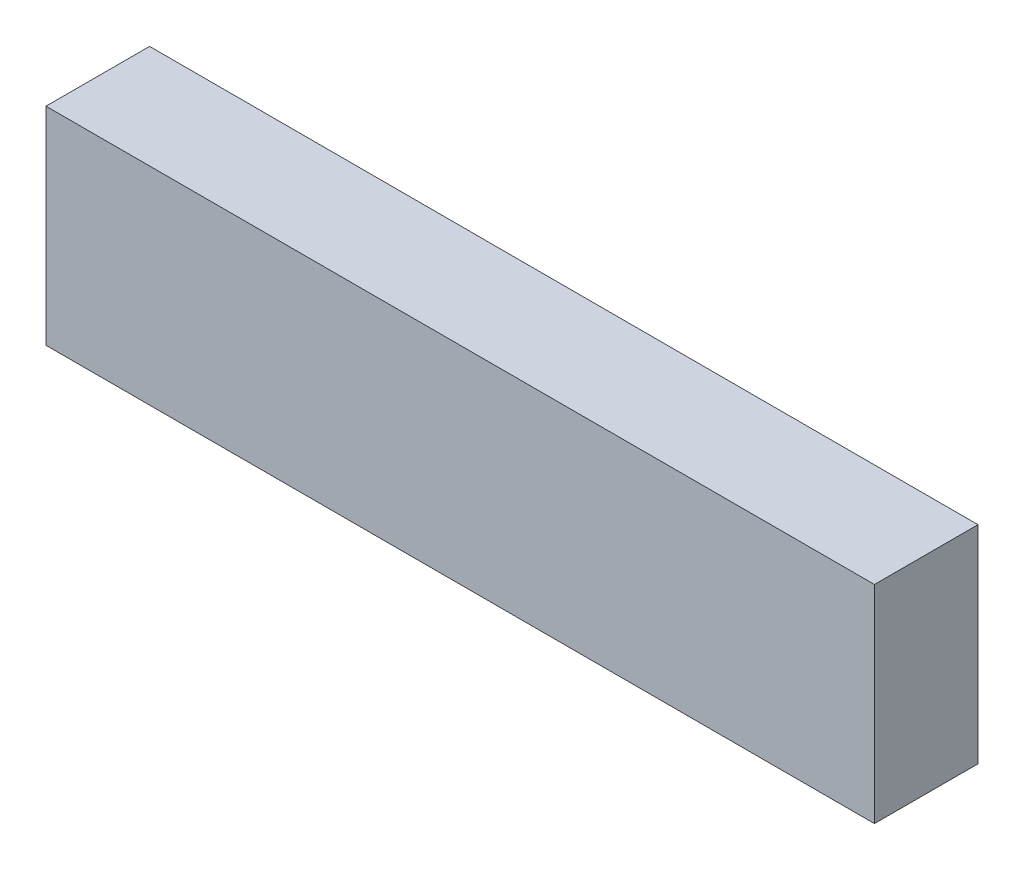
ISO-10303-21;
HEADER;
FILE_DESCRIPTION(('STEP AP214'),'2;1');
FILE_NAME('part.step','',(''),(''),'','','');
FILE_SCHEMA(('AUTOMOTIVE_DESIGN { 1 0 10303 214 1 1 1 1 }'));
ENDSEC;
DATA;
#1=APPLICATION_CONTEXT('core data for automotive mechanical design processes');
#2=APPLICATION_PROTOCOL_DEFINITION('international standard','automotive_design',2000,#1);
#3=PRODUCT_CONTEXT('',#1,'mechanical');
#4=PRODUCT('Part','Part','',(#3));
#5=PRODUCT_RELATED_PRODUCT_CATEGORY('part','',(#4));
#6=PRODUCT_DEFINITION_FORMATION('','',#4);
#7=PRODUCT_DEFINITION_CONTEXT('part definition',#1,'design');
#8=PRODUCT_DEFINITION('design','',#6,#7);
#9=PRODUCT_DEFINITION_SHAPE('','',#8);
#10=(LENGTH_UNIT() NAMED_UNIT(*) SI_UNIT(.MILLI.,.METRE.));
#11=(NAMED_UNIT(*) PLANE_ANGLE_UNIT() SI_UNIT($,.RADIAN.));
#12=(NAMED_UNIT(*) SI_UNIT($,.STERADIAN.) SOLID_ANGLE_UNIT());
#13=UNCERTAINTY_MEASURE_WITH_UNIT(LENGTH_MEASURE(1.E-05),#10,'distance_accuracy_value','');
#14=(GEOMETRIC_REPRESENTATION_CONTEXT(3) GLOBAL_UNCERTAINTY_ASSIGNED_CONTEXT((#13)) GLOBAL_UNIT_ASSIGNED_CONTEXT((#10,
#11,#12)) REPRESENTATION_CONTEXT('',''));
#15=CARTESIAN_POINT('',(0.,0.,0.));
#16=DIRECTION('',(0.,0.,1.));
#17=DIRECTION('',(1.,0.,0.));
#18=AXIS2_PLACEMENT_3D('',#15,#16,#17);
#19=CARTESIAN_POINT('',(0.,0.,63.5));
#20=DIRECTION('',(1.,0.,0.));
#21=DIRECTION('',(0.,0.,-1.));
#22=AXIS2_PLACEMENT_3D('',#19,#20,#21);
#23=PLANE('',#22);
#24=DIRECTION('',(0.,-1.,0.));
#25=VECTOR('',#24,1.);
#26=CARTESIAN_POINT('',(0.,0.,0.));
#27=LINE('',#26,#25);
#28=CARTESIAN_POINT('',(0.,127.,0.));
#29=VERTEX_POINT('',#28);
#30=CARTESIAN_POINT('',(0.,0.,0.));
#31=VERTEX_POINT('',#30);
#32=EDGE_CURVE('E96',#29,#31,#27,.T.);
#33=ORIENTED_EDGE('',*,*,#32,.T.);
#34=DIRECTION('',(0.,0.,-1.));
#35=VECTOR('',#34,1.);
#36=CARTESIAN_POINT('',(0.,0.,63.5));
#37=LINE('',#36,#35);
#38=CARTESIAN_POINT('',(0.,0.,63.5));
#39=VERTEX_POINT('',#38);
#40=EDGE_CURVE('E11',#39,#31,#37,.T.);
#41=ORIENTED_EDGE('',*,*,#40,.F.);
#42=DIRECTION('',(0.,-1.,0.));
#43=VECTOR('',#42,1.);
#44=CARTESIAN_POINT('',(0.,0.,63.5));
#45=LINE('',#44,#43);
#46=CARTESIAN_POINT('',(0.,127.,63.5));
#47=VERTEX_POINT('',#46);
#48=EDGE_CURVE('E84',#47,#39,#45,.T.);
#49=ORIENTED_EDGE('',*,*,#48,.F.);
#50=DIRECTION('',(0.,0.,-1.));
#51=VECTOR('',#50,1.);
#52=CARTESIAN_POINT('',(0.,127.,63.5));
#53=LINE('',#52,#51);
#54=EDGE_CURVE('E92',#47,#29,#53,.T.);
#55=ORIENTED_EDGE('',*,*,#54,.T.);
#56=EDGE_LOOP('',(#33,#41,#49,#55));
#57=FACE_BOUND('',#56,.T.);
#58=ADVANCED_FACE('F33',(#57),#23,.F.);
#59=CARTESIAN_POINT('',(0.,0.,63.5));
#60=DIRECTION('',(0.,1.,0.));
#61=DIRECTION('',(0.,0.,1.));
#62=AXIS2_PLACEMENT_3D('',#59,#60,#61);
#63=PLANE('',#62);
#64=DIRECTION('',(1.,0.,0.));
#65=VECTOR('',#64,1.);
#66=CARTESIAN_POINT('',(0.,0.,0.));
#67=LINE('',#66,#65);
#68=CARTESIAN_POINT('',(508.,0.,0.));
#69=VERTEX_POINT('',#68);
#70=EDGE_CURVE('E88',#31,#69,#67,.T.);
#71=ORIENTED_EDGE('',*,*,#70,.T.);
#72=DIRECTION('',(0.,0.,-1.));
#73=VECTOR('',#72,1.);
#74=CARTESIAN_POINT('',(508.,0.,63.5));
#75=LINE('',#74,#73);
#76=CARTESIAN_POINT('',(508.,0.,63.5));
#77=VERTEX_POINT('',#76);
#78=EDGE_CURVE('E41',#77,#69,#75,.T.);
#79=ORIENTED_EDGE('',*,*,#78,.F.);
#80=DIRECTION('',(1.,0.,0.));
#81=VECTOR('',#80,1.);
#82=CARTESIAN_POINT('',(0.,0.,63.5));
#83=LINE('',#82,#81);
#84=EDGE_CURVE('E79',#39,#77,#83,.T.);
#85=ORIENTED_EDGE('',*,*,#84,.F.);
#86=ORIENTED_EDGE('',*,*,#40,.T.);
#87=EDGE_LOOP('',(#71,#79,#85,#86));
#88=FACE_BOUND('',#87,.T.);
#89=ADVANCED_FACE('F87',(#88),#63,.F.);
#90=CARTESIAN_POINT('',(508.,0.,63.5));
#91=DIRECTION('',(-1.,0.,0.));
#92=DIRECTION('',(0.,0.,1.));
#93=AXIS2_PLACEMENT_3D('',#90,#91,#92);
#94=PLANE('',#93);
#95=DIRECTION('',(0.,1.,0.));
#96=VECTOR('',#95,1.);
#97=CARTESIAN_POINT('',(508.,0.,0.));
#98=LINE('',#97,#96);
#99=CARTESIAN_POINT('',(508.,127.,0.));
#100=VERTEX_POINT('',#99);
#101=EDGE_CURVE('E66',#69,#100,#98,.T.);
#102=ORIENTED_EDGE('',*,*,#101,.T.);
#103=DIRECTION('',(0.,0.,-1.));
#104=VECTOR('',#103,1.);
#105=CARTESIAN_POINT('',(508.,127.,63.5));
#106=LINE('',#105,#104);
#107=CARTESIAN_POINT('',(508.,127.,63.5));
#108=VERTEX_POINT('',#107);
#109=EDGE_CURVE('E89',#108,#100,#106,.T.);
#110=ORIENTED_EDGE('',*,*,#109,.F.);
#111=DIRECTION('',(0.,1.,0.));
#112=VECTOR('',#111,1.);
#113=CARTESIAN_POINT('',(508.,0.,63.5));
#114=LINE('',#113,#112);
#115=EDGE_CURVE('E82',#77,#108,#114,.T.);
#116=ORIENTED_EDGE('',*,*,#115,.F.);
#117=ORIENTED_EDGE('',*,*,#78,.T.);
#118=EDGE_LOOP('',(#102,#110,#116,#117));
#119=FACE_BOUND('',#118,.T.);
#120=ADVANCED_FACE('F90',(#119),#94,.F.);
#121=CARTESIAN_POINT('',(0.,127.,63.5));
#122=DIRECTION('',(0.,-1.,0.));
#123=DIRECTION('',(0.,0.,-1.));
#124=AXIS2_PLACEMENT_3D('',#121,#122,#123);
#125=PLANE('',#124);
#126=DIRECTION('',(-1.,0.,0.));
#127=VECTOR('',#126,1.);
#128=CARTESIAN_POINT('',(0.,127.,0.));
#129=LINE('',#128,#127);
#130=EDGE_CURVE('E72',#100,#29,#129,.T.);
#131=ORIENTED_EDGE('',*,*,#130,.T.);
#132=ORIENTED_EDGE('',*,*,#54,.F.);
#133=DIRECTION('',(-1.,0.,0.));
#134=VECTOR('',#133,1.);
#135=CARTESIAN_POINT('',(0.,127.,63.5));
#136=LINE('',#135,#134);
#137=EDGE_CURVE('E49',#108,#47,#136,.T.);
#138=ORIENTED_EDGE('',*,*,#137,.F.);
#139=ORIENTED_EDGE('',*,*,#109,.T.);
#140=EDGE_LOOP('',(#131,#132,#138,#139));
#141=FACE_BOUND('',#140,.T.);
#142=ADVANCED_FACE('F103',(#141),#125,.F.);
#143=CARTESIAN_POINT('',(0.,0.,63.5));
#144=DIRECTION('',(0.,0.,-1.));
#145=DIRECTION('',(-1.,0.,0.));
#146=AXIS2_PLACEMENT_3D('',#143,#144,#145);
#147=PLANE('',#146);
#148=ORIENTED_EDGE('',*,*,#48,.T.);
#149=ORIENTED_EDGE('',*,*,#84,.T.);
#150=ORIENTED_EDGE('',*,*,#115,.T.);
#151=ORIENTED_EDGE('',*,*,#137,.T.);
#152=EDGE_LOOP('',(#148,#149,#150,#151));
#153=FACE_BOUND('',#152,.T.);
#154=ADVANCED_FACE('F80',(#153),#147,.F.);
#155=CARTESIAN_POINT('',(0.,0.,0.));
#156=DIRECTION('',(0.,0.,-1.));
#157=DIRECTION('',(-1.,0.,0.));
#158=AXIS2_PLACEMENT_3D('',#155,#156,#157);
#159=PLANE('',#158);
#160=ORIENTED_EDGE('',*,*,#32,.F.);
#161=ORIENTED_EDGE('',*,*,#130,.F.);
#162=ORIENTED_EDGE('',*,*,#101,.F.);
#163=ORIENTED_EDGE('',*,*,#70,.F.);
#164=EDGE_LOOP('',(#160,#161,#162,#163));
#165=FACE_BOUND('',#164,.T.);
#166=ADVANCED_FACE('F106',(#165),#159,.T.);
#167=CLOSED_SHELL('',(#58,#89,#120,#142,#154,#166));
#168=MANIFOLD_SOLID_BREP('B2',#167);
#169=ADVANCED_BREP_SHAPE_REPRESENTATION('',(#18,#168),#14);
#170=SHAPE_DEFINITION_REPRESENTATION(#9,#169);
ENDSEC;
END-ISO-10303-21;
